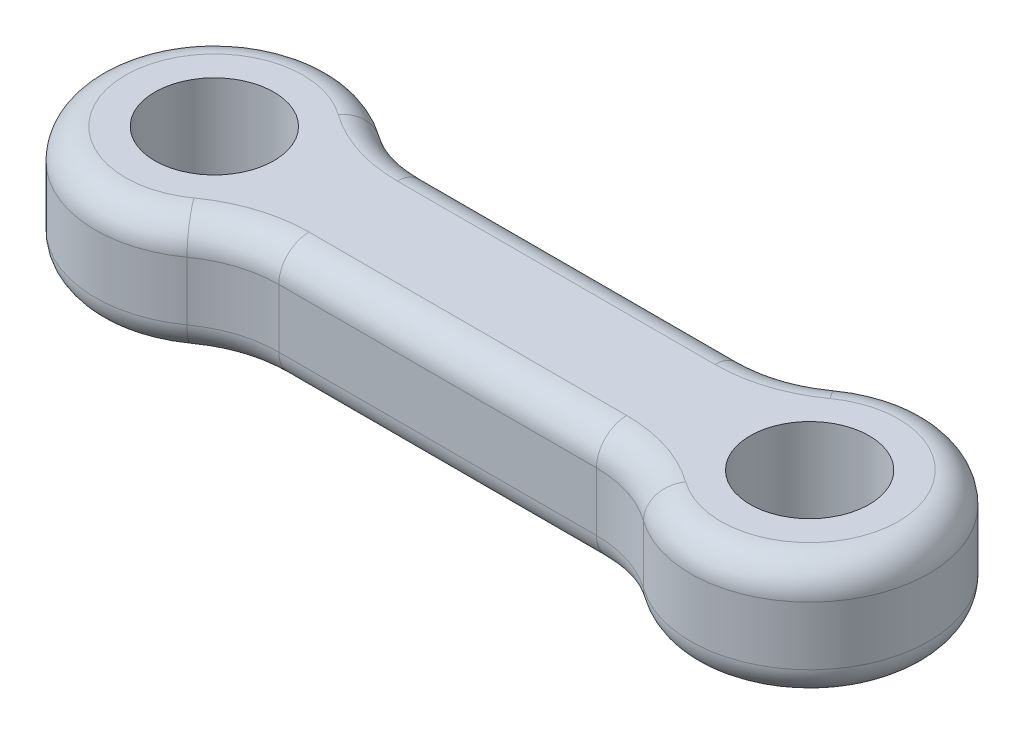
ISO-10303-21;
HEADER;
FILE_DESCRIPTION(('STEP AP214'),'2;1');
FILE_NAME('part.step','',(''),(''),'','','');
FILE_SCHEMA(('AUTOMOTIVE_DESIGN { 1 0 10303 214 1 1 1 1 }'));
ENDSEC;
DATA;
#1=APPLICATION_CONTEXT('core data for automotive mechanical design processes');
#2=APPLICATION_PROTOCOL_DEFINITION('international standard','automotive_design',2000,#1);
#3=PRODUCT_CONTEXT('',#1,'mechanical');
#4=PRODUCT('Part','Part','',(#3));
#5=PRODUCT_RELATED_PRODUCT_CATEGORY('part','',(#4));
#6=PRODUCT_DEFINITION_FORMATION('','',#4);
#7=PRODUCT_DEFINITION_CONTEXT('part definition',#1,'design');
#8=PRODUCT_DEFINITION('design','',#6,#7);
#9=PRODUCT_DEFINITION_SHAPE('','',#8);
#10=(LENGTH_UNIT() NAMED_UNIT(*) SI_UNIT(.MILLI.,.METRE.));
#11=(NAMED_UNIT(*) PLANE_ANGLE_UNIT() SI_UNIT($,.RADIAN.));
#12=(NAMED_UNIT(*) SI_UNIT($,.STERADIAN.) SOLID_ANGLE_UNIT());
#13=UNCERTAINTY_MEASURE_WITH_UNIT(LENGTH_MEASURE(1.E-05),#10,'distance_accuracy_value','');
#14=(GEOMETRIC_REPRESENTATION_CONTEXT(3) GLOBAL_UNCERTAINTY_ASSIGNED_CONTEXT((#13)) GLOBAL_UNIT_ASSIGNED_CONTEXT((#10,
#11,#12)) REPRESENTATION_CONTEXT('',''));
#15=CARTESIAN_POINT('',(0.,0.,0.));
#16=DIRECTION('',(0.,0.,1.));
#17=DIRECTION('',(1.,0.,0.));
#18=AXIS2_PLACEMENT_3D('',#15,#16,#17);
#19=CARTESIAN_POINT('',(3.69508771879827,8.3,-10.725));
#20=DIRECTION('',(0.,1.,0.));
#21=DIRECTION('',(0.,0.,1.));
#22=AXIS2_PLACEMENT_3D('',#19,#20,#21);
#23=PLANE('',#22);
#24=CARTESIAN_POINT('',(21.3049122812017,8.3,10.725));
#25=DIRECTION('',(0.,1.,0.));
#26=DIRECTION('',(0.,0.,1.));
#27=AXIS2_PLACEMENT_3D('',#24,#25,#26);
#28=CIRCLE('',#27,8.2764);
#29=CARTESIAN_POINT('',(21.3049122812017,8.3,2.4486));
#30=VERTEX_POINT('',#29);
#31=CARTESIAN_POINT('',(26.1297322808882,8.3,4.000425));
#32=VERTEX_POINT('',#31);
#33=EDGE_CURVE('E268',#30,#32,#28,.F.);
#34=ORIENTED_EDGE('',*,*,#33,.T.);
#35=CARTESIAN_POINT('',(29.,8.3,0.));
#36=DIRECTION('',(0.,1.,0.));
#37=DIRECTION('',(0.,0.,1.));
#38=AXIS2_PLACEMENT_3D('',#35,#36,#37);
#39=CIRCLE('',#38,4.9236);
#40=CARTESIAN_POINT('',(26.1297322808882,8.3,-4.000425));
#41=VERTEX_POINT('',#40);
#42=EDGE_CURVE('E155',#32,#41,#39,.T.);
#43=ORIENTED_EDGE('',*,*,#42,.T.);
#44=CARTESIAN_POINT('',(21.3049122812017,8.3,-10.725));
#45=DIRECTION('',(0.,1.,0.));
#46=DIRECTION('',(0.,0.,1.));
#47=AXIS2_PLACEMENT_3D('',#44,#45,#46);
#48=CIRCLE('',#47,8.2764);
#49=CARTESIAN_POINT('',(21.3049122812017,8.3,-2.4486));
#50=VERTEX_POINT('',#49);
#51=EDGE_CURVE('E149',#41,#50,#48,.F.);
#52=ORIENTED_EDGE('',*,*,#51,.T.);
#53=DIRECTION('',(-1.,0.,0.));
#54=VECTOR('',#53,1.);
#55=CARTESIAN_POINT('',(3.69508771879827,8.3,-2.4486));
#56=LINE('',#55,#54);
#57=CARTESIAN_POINT('',(3.69508771879827,8.3,-2.4486));
#58=VERTEX_POINT('',#57);
#59=EDGE_CURVE('E152',#50,#58,#56,.T.);
#60=ORIENTED_EDGE('',*,*,#59,.T.);
#61=CARTESIAN_POINT('',(3.69508771879827,8.3,-10.725));
#62=DIRECTION('',(0.,1.,0.));
#63=DIRECTION('',(0.,0.,1.));
#64=AXIS2_PLACEMENT_3D('',#61,#62,#63);
#65=CIRCLE('',#64,8.2764);
#66=CARTESIAN_POINT('',(-1.12973228088824,8.3,-4.000425));
#67=VERTEX_POINT('',#66);
#68=EDGE_CURVE('E159',#58,#67,#65,.F.);
#69=ORIENTED_EDGE('',*,*,#68,.T.);
#70=CARTESIAN_POINT('',(-4.,8.3,0.));
#71=DIRECTION('',(0.,1.,0.));
#72=DIRECTION('',(0.,0.,1.));
#73=AXIS2_PLACEMENT_3D('',#70,#71,#72);
#74=CIRCLE('',#73,4.9236);
#75=CARTESIAN_POINT('',(-1.12973228088825,8.3,4.000425));
#76=VERTEX_POINT('',#75);
#77=EDGE_CURVE('E274',#67,#76,#74,.T.);
#78=ORIENTED_EDGE('',*,*,#77,.T.);
#79=CARTESIAN_POINT('',(3.69508771879827,8.3,10.725));
#80=DIRECTION('',(0.,1.,0.));
#81=DIRECTION('',(0.,0.,1.));
#82=AXIS2_PLACEMENT_3D('',#79,#80,#81);
#83=CIRCLE('',#82,8.2764);
#84=CARTESIAN_POINT('',(3.69508771879827,8.3,2.4486));
#85=VERTEX_POINT('',#84);
#86=EDGE_CURVE('E272',#76,#85,#83,.F.);
#87=ORIENTED_EDGE('',*,*,#86,.T.);
#88=DIRECTION('',(1.,0.,0.));
#89=VECTOR('',#88,1.);
#90=CARTESIAN_POINT('',(21.3049122812017,8.3,2.4486));
#91=LINE('',#90,#89);
#92=EDGE_CURVE('E270',#85,#30,#91,.T.);
#93=ORIENTED_EDGE('',*,*,#92,.T.);
#94=EDGE_LOOP('',(#34,#43,#52,#60,#69,#78,#87,#93));
#95=FACE_BOUND('',#94,.T.);
#96=CARTESIAN_POINT('',(-4.,8.3,0.));
#97=DIRECTION('',(0.,1.,0.));
#98=DIRECTION('',(0.,0.,1.));
#99=AXIS2_PLACEMENT_3D('',#96,#97,#98);
#100=CIRCLE('',#99,3.3);
#101=CARTESIAN_POINT('',(-4.,8.3,3.3));
#102=VERTEX_POINT('',#101);
#103=EDGE_CURVE('E298',#102,#102,#100,.T.);
#104=ORIENTED_EDGE('',*,*,#103,.F.);
#105=EDGE_LOOP('',(#104));
#106=FACE_BOUND('',#105,.T.);
#107=CARTESIAN_POINT('',(29.,8.3,0.));
#108=DIRECTION('',(0.,1.,0.));
#109=DIRECTION('',(0.,0.,-1.));
#110=AXIS2_PLACEMENT_3D('',#107,#108,#109);
#111=CIRCLE('',#110,3.3);
#112=CARTESIAN_POINT('',(29.,8.3,-3.3));
#113=VERTEX_POINT('',#112);
#114=EDGE_CURVE('E302',#113,#113,#111,.T.);
#115=ORIENTED_EDGE('',*,*,#114,.F.);
#116=EDGE_LOOP('',(#115));
#117=FACE_BOUND('',#116,.T.);
#118=ADVANCED_FACE('F34',(#95,#106,#117),#23,.T.);
#119=CARTESIAN_POINT('',(3.69508771879827,1.7,-10.725));
#120=DIRECTION('',(0.,1.,0.));
#121=DIRECTION('',(0.,0.,1.));
#122=AXIS2_PLACEMENT_3D('',#119,#120,#121);
#123=PLANE('',#122);
#124=CARTESIAN_POINT('',(3.69508771879827,1.7,10.725));
#125=DIRECTION('',(0.,1.,0.));
#126=DIRECTION('',(0.,0.,1.));
#127=AXIS2_PLACEMENT_3D('',#124,#125,#126);
#128=CIRCLE('',#127,8.2764);
#129=CARTESIAN_POINT('',(3.69508771879827,1.7,2.4486));
#130=VERTEX_POINT('',#129);
#131=CARTESIAN_POINT('',(-1.12973228088825,1.7,4.000425));
#132=VERTEX_POINT('',#131);
#133=EDGE_CURVE('E227',#130,#132,#128,.T.);
#134=ORIENTED_EDGE('',*,*,#133,.T.);
#135=CARTESIAN_POINT('',(-4.,1.7,0.));
#136=DIRECTION('',(0.,1.,0.));
#137=DIRECTION('',(0.,0.,1.));
#138=AXIS2_PLACEMENT_3D('',#135,#136,#137);
#139=CIRCLE('',#138,4.9236);
#140=CARTESIAN_POINT('',(-1.12973228088824,1.7,-4.000425));
#141=VERTEX_POINT('',#140);
#142=EDGE_CURVE('E224',#132,#141,#139,.F.);
#143=ORIENTED_EDGE('',*,*,#142,.T.);
#144=CARTESIAN_POINT('',(3.69508771879827,1.7,-10.725));
#145=DIRECTION('',(0.,1.,0.));
#146=DIRECTION('',(0.,0.,1.));
#147=AXIS2_PLACEMENT_3D('',#144,#145,#146);
#148=CIRCLE('',#147,8.2764);
#149=CARTESIAN_POINT('',(3.69508771879827,1.7,-2.4486));
#150=VERTEX_POINT('',#149);
#151=EDGE_CURVE('E239',#141,#150,#148,.T.);
#152=ORIENTED_EDGE('',*,*,#151,.T.);
#153=DIRECTION('',(-1.,0.,0.));
#154=VECTOR('',#153,1.);
#155=CARTESIAN_POINT('',(3.69508771879827,1.7,-2.4486));
#156=LINE('',#155,#154);
#157=CARTESIAN_POINT('',(21.3049122812017,1.7,-2.4486));
#158=VERTEX_POINT('',#157);
#159=EDGE_CURVE('E237',#150,#158,#156,.F.);
#160=ORIENTED_EDGE('',*,*,#159,.T.);
#161=CARTESIAN_POINT('',(21.3049122812017,1.7,-10.725));
#162=DIRECTION('',(0.,1.,0.));
#163=DIRECTION('',(0.,0.,1.));
#164=AXIS2_PLACEMENT_3D('',#161,#162,#163);
#165=CIRCLE('',#164,8.2764);
#166=CARTESIAN_POINT('',(26.1297322808882,1.7,-4.000425));
#167=VERTEX_POINT('',#166);
#168=EDGE_CURVE('E235',#158,#167,#165,.T.);
#169=ORIENTED_EDGE('',*,*,#168,.T.);
#170=CARTESIAN_POINT('',(29.,1.7,0.));
#171=DIRECTION('',(0.,1.,0.));
#172=DIRECTION('',(0.,0.,1.));
#173=AXIS2_PLACEMENT_3D('',#170,#171,#172);
#174=CIRCLE('',#173,4.9236);
#175=CARTESIAN_POINT('',(26.1297322808883,1.7,4.000425));
#176=VERTEX_POINT('',#175);
#177=EDGE_CURVE('E233',#167,#176,#174,.F.);
#178=ORIENTED_EDGE('',*,*,#177,.T.);
#179=CARTESIAN_POINT('',(21.3049122812017,1.7,10.725));
#180=DIRECTION('',(0.,1.,0.));
#181=DIRECTION('',(0.,0.,1.));
#182=AXIS2_PLACEMENT_3D('',#179,#180,#181);
#183=CIRCLE('',#182,8.2764);
#184=CARTESIAN_POINT('',(21.3049122812017,1.7,2.4486));
#185=VERTEX_POINT('',#184);
#186=EDGE_CURVE('E231',#176,#185,#183,.T.);
#187=ORIENTED_EDGE('',*,*,#186,.T.);
#188=DIRECTION('',(1.,0.,0.));
#189=VECTOR('',#188,1.);
#190=CARTESIAN_POINT('',(3.69508771879827,1.7,2.4486));
#191=LINE('',#190,#189);
#192=EDGE_CURVE('E229',#185,#130,#191,.F.);
#193=ORIENTED_EDGE('',*,*,#192,.T.);
#194=EDGE_LOOP('',(#134,#143,#152,#160,#169,#178,#187,#193));
#195=FACE_BOUND('',#194,.T.);
#196=CARTESIAN_POINT('',(-4.,1.7,0.));
#197=DIRECTION('',(0.,1.,0.));
#198=DIRECTION('',(0.,0.,1.));
#199=AXIS2_PLACEMENT_3D('',#196,#197,#198);
#200=CIRCLE('',#199,3.3);
#201=CARTESIAN_POINT('',(-4.,1.7,3.3));
#202=VERTEX_POINT('',#201);
#203=EDGE_CURVE('E299',#202,#202,#200,.T.);
#204=ORIENTED_EDGE('',*,*,#203,.T.);
#205=EDGE_LOOP('',(#204));
#206=FACE_BOUND('',#205,.T.);
#207=CARTESIAN_POINT('',(29.,1.7,0.));
#208=DIRECTION('',(0.,1.,0.));
#209=DIRECTION('',(0.,0.,-1.));
#210=AXIS2_PLACEMENT_3D('',#207,#208,#209);
#211=CIRCLE('',#210,3.3);
#212=CARTESIAN_POINT('',(29.,1.7,-3.3));
#213=VERTEX_POINT('',#212);
#214=EDGE_CURVE('E192',#213,#213,#211,.T.);
#215=ORIENTED_EDGE('',*,*,#214,.T.);
#216=EDGE_LOOP('',(#215));
#217=FACE_BOUND('',#216,.T.);
#218=ADVANCED_FACE('F314',(#195,#206,#217),#123,.F.);
#219=CARTESIAN_POINT('',(3.69508771879827,8.3,-10.725));
#220=DIRECTION('',(0.,-1.,0.));
#221=DIRECTION('',(0.,0.,-1.));
#222=AXIS2_PLACEMENT_3D('',#219,#220,#221);
#223=CYLINDRICAL_SURFACE('',#222,6.6);
#224=DIRECTION('',(0.,-1.,0.));
#225=VECTOR('',#224,1.);
#226=CARTESIAN_POINT('',(-0.152456140600862,8.3,-5.3625));
#227=LINE('',#226,#225);
#228=CARTESIAN_POINT('',(-0.152456140600862,6.6236,-5.3625));
#229=VERTEX_POINT('',#228);
#230=CARTESIAN_POINT('',(-0.152456140600862,3.3764,-5.3625));
#231=VERTEX_POINT('',#230);
#232=EDGE_CURVE('E169',#229,#231,#227,.T.);
#233=ORIENTED_EDGE('',*,*,#232,.F.);
#234=CARTESIAN_POINT('',(3.69508771879827,6.6236,-10.725));
#235=DIRECTION('',(0.,1.,0.));
#236=DIRECTION('',(0.,0.,1.));
#237=AXIS2_PLACEMENT_3D('',#234,#235,#236);
#238=CIRCLE('',#237,6.6);
#239=CARTESIAN_POINT('',(3.69508771879827,6.6236,-4.125));
#240=VERTEX_POINT('',#239);
#241=EDGE_CURVE('E241',#229,#240,#238,.T.);
#242=ORIENTED_EDGE('',*,*,#241,.T.);
#243=DIRECTION('',(0.,-1.,0.));
#244=VECTOR('',#243,1.);
#245=CARTESIAN_POINT('',(3.69508771879827,8.3,-4.125));
#246=LINE('',#245,#244);
#247=CARTESIAN_POINT('',(3.69508771879827,3.3764,-4.125));
#248=VERTEX_POINT('',#247);
#249=EDGE_CURVE('E295',#240,#248,#246,.T.);
#250=ORIENTED_EDGE('',*,*,#249,.T.);
#251=CARTESIAN_POINT('',(3.69508771879827,3.3764,-10.725));
#252=DIRECTION('',(0.,1.,0.));
#253=DIRECTION('',(0.,0.,1.));
#254=AXIS2_PLACEMENT_3D('',#251,#252,#253);
#255=CIRCLE('',#254,6.6);
#256=EDGE_CURVE('E243',#248,#231,#255,.F.);
#257=ORIENTED_EDGE('',*,*,#256,.T.);
#258=EDGE_LOOP('',(#233,#242,#250,#257));
#259=FACE_BOUND('',#258,.T.);
#260=ADVANCED_FACE('F319',(#259),#223,.F.);
#261=CARTESIAN_POINT('',(-4.,8.3,0.));
#262=DIRECTION('',(0.,-1.,0.));
#263=DIRECTION('',(0.,0.,-1.));
#264=AXIS2_PLACEMENT_3D('',#261,#262,#263);
#265=CYLINDRICAL_SURFACE('',#264,6.6);
#266=DIRECTION('',(0.,-1.,0.));
#267=VECTOR('',#266,1.);
#268=CARTESIAN_POINT('',(-0.152456140600865,8.3,5.3625));
#269=LINE('',#268,#267);
#270=CARTESIAN_POINT('',(-0.152456140600865,6.6236,5.3625));
#271=VERTEX_POINT('',#270);
#272=CARTESIAN_POINT('',(-0.152456140600865,3.3764,5.3625));
#273=VERTEX_POINT('',#272);
#274=EDGE_CURVE('E279',#271,#273,#269,.T.);
#275=ORIENTED_EDGE('',*,*,#274,.F.);
#276=CARTESIAN_POINT('',(-4.,6.6236,0.));
#277=DIRECTION('',(0.,1.,0.));
#278=DIRECTION('',(0.,0.,1.));
#279=AXIS2_PLACEMENT_3D('',#276,#277,#278);
#280=CIRCLE('',#279,6.6);
#281=EDGE_CURVE('E245',#271,#229,#280,.F.);
#282=ORIENTED_EDGE('',*,*,#281,.T.);
#283=ORIENTED_EDGE('',*,*,#232,.T.);
#284=CARTESIAN_POINT('',(-4.,3.3764,0.));
#285=DIRECTION('',(0.,1.,0.));
#286=DIRECTION('',(0.,0.,1.));
#287=AXIS2_PLACEMENT_3D('',#284,#285,#286);
#288=CIRCLE('',#287,6.6);
#289=EDGE_CURVE('E247',#231,#273,#288,.T.);
#290=ORIENTED_EDGE('',*,*,#289,.T.);
#291=EDGE_LOOP('',(#275,#282,#283,#290));
#292=FACE_BOUND('',#291,.T.);
#293=ADVANCED_FACE('F347',(#292),#265,.T.);
#294=CARTESIAN_POINT('',(3.69508771879827,8.3,10.725));
#295=DIRECTION('',(0.,-1.,0.));
#296=DIRECTION('',(0.,0.,-1.));
#297=AXIS2_PLACEMENT_3D('',#294,#295,#296);
#298=CYLINDRICAL_SURFACE('',#297,6.6);
#299=DIRECTION('',(0.,-1.,0.));
#300=VECTOR('',#299,1.);
#301=CARTESIAN_POINT('',(3.69508771879827,8.3,4.125));
#302=LINE('',#301,#300);
#303=CARTESIAN_POINT('',(3.69508771879827,6.6236,4.125));
#304=VERTEX_POINT('',#303);
#305=CARTESIAN_POINT('',(3.69508771879827,3.3764,4.125));
#306=VERTEX_POINT('',#305);
#307=EDGE_CURVE('E282',#304,#306,#302,.T.);
#308=ORIENTED_EDGE('',*,*,#307,.F.);
#309=CARTESIAN_POINT('',(3.69508771879827,6.6236,10.725));
#310=DIRECTION('',(0.,1.,0.));
#311=DIRECTION('',(0.,0.,1.));
#312=AXIS2_PLACEMENT_3D('',#309,#310,#311);
#313=CIRCLE('',#312,6.6);
#314=EDGE_CURVE('E250',#304,#271,#313,.T.);
#315=ORIENTED_EDGE('',*,*,#314,.T.);
#316=ORIENTED_EDGE('',*,*,#274,.T.);
#317=CARTESIAN_POINT('',(3.69508771879827,3.3764,10.725));
#318=DIRECTION('',(0.,1.,0.));
#319=DIRECTION('',(0.,0.,1.));
#320=AXIS2_PLACEMENT_3D('',#317,#318,#319);
#321=CIRCLE('',#320,6.6);
#322=EDGE_CURVE('E252',#273,#306,#321,.F.);
#323=ORIENTED_EDGE('',*,*,#322,.T.);
#324=EDGE_LOOP('',(#308,#315,#316,#323));
#325=FACE_BOUND('',#324,.T.);
#326=ADVANCED_FACE('F343',(#325),#298,.F.);
#327=CARTESIAN_POINT('',(3.69508771879827,8.3,4.125));
#328=DIRECTION('',(0.,0.,-1.));
#329=DIRECTION('',(-1.,0.,0.));
#330=AXIS2_PLACEMENT_3D('',#327,#328,#329);
#331=PLANE('',#330);
#332=DIRECTION('',(0.,-1.,0.));
#333=VECTOR('',#332,1.);
#334=CARTESIAN_POINT('',(21.3049122812017,8.3,4.125));
#335=LINE('',#334,#333);
#336=CARTESIAN_POINT('',(21.3049122812017,6.6236,4.125));
#337=VERTEX_POINT('',#336);
#338=CARTESIAN_POINT('',(21.3049122812017,3.3764,4.125));
#339=VERTEX_POINT('',#338);
#340=EDGE_CURVE('E285',#337,#339,#335,.T.);
#341=ORIENTED_EDGE('',*,*,#340,.F.);
#342=DIRECTION('',(1.,0.,0.));
#343=VECTOR('',#342,1.);
#344=CARTESIAN_POINT('',(3.69508771879827,6.6236,4.125));
#345=LINE('',#344,#343);
#346=EDGE_CURVE('E254',#337,#304,#345,.F.);
#347=ORIENTED_EDGE('',*,*,#346,.T.);
#348=ORIENTED_EDGE('',*,*,#307,.T.);
#349=DIRECTION('',(1.,0.,0.));
#350=VECTOR('',#349,1.);
#351=CARTESIAN_POINT('',(3.69508771879827,3.3764,4.125));
#352=LINE('',#351,#350);
#353=EDGE_CURVE('E256',#306,#339,#352,.T.);
#354=ORIENTED_EDGE('',*,*,#353,.T.);
#355=EDGE_LOOP('',(#341,#347,#348,#354));
#356=FACE_BOUND('',#355,.T.);
#357=ADVANCED_FACE('F339',(#356),#331,.F.);
#358=CARTESIAN_POINT('',(21.3049122812017,8.3,10.725));
#359=DIRECTION('',(0.,-1.,0.));
#360=DIRECTION('',(0.,0.,-1.));
#361=AXIS2_PLACEMENT_3D('',#358,#359,#360);
#362=CYLINDRICAL_SURFACE('',#361,6.6);
#363=DIRECTION('',(0.,-1.,0.));
#364=VECTOR('',#363,1.);
#365=CARTESIAN_POINT('',(25.1524561406009,8.3,5.3625));
#366=LINE('',#365,#364);
#367=CARTESIAN_POINT('',(25.1524561406009,6.6236,5.3625));
#368=VERTEX_POINT('',#367);
#369=CARTESIAN_POINT('',(25.1524561406009,3.3764,5.3625));
#370=VERTEX_POINT('',#369);
#371=EDGE_CURVE('E288',#368,#370,#366,.T.);
#372=ORIENTED_EDGE('',*,*,#371,.F.);
#373=CARTESIAN_POINT('',(21.3049122812017,6.6236,10.725));
#374=DIRECTION('',(0.,1.,0.));
#375=DIRECTION('',(0.,0.,1.));
#376=AXIS2_PLACEMENT_3D('',#373,#374,#375);
#377=CIRCLE('',#376,6.6);
#378=EDGE_CURVE('E258',#368,#337,#377,.T.);
#379=ORIENTED_EDGE('',*,*,#378,.T.);
#380=ORIENTED_EDGE('',*,*,#340,.T.);
#381=CARTESIAN_POINT('',(21.3049122812017,3.3764,10.725));
#382=DIRECTION('',(0.,1.,0.));
#383=DIRECTION('',(0.,0.,1.));
#384=AXIS2_PLACEMENT_3D('',#381,#382,#383);
#385=CIRCLE('',#384,6.6);
#386=EDGE_CURVE('E260',#339,#370,#385,.F.);
#387=ORIENTED_EDGE('',*,*,#386,.T.);
#388=EDGE_LOOP('',(#372,#379,#380,#387));
#389=FACE_BOUND('',#388,.T.);
#390=ADVANCED_FACE('F335',(#389),#362,.F.);
#391=CARTESIAN_POINT('',(29.,8.3,0.));
#392=DIRECTION('',(0.,-1.,0.));
#393=DIRECTION('',(0.,0.,-1.));
#394=AXIS2_PLACEMENT_3D('',#391,#392,#393);
#395=CYLINDRICAL_SURFACE('',#394,6.6);
#396=DIRECTION('',(0.,-1.,0.));
#397=VECTOR('',#396,1.);
#398=CARTESIAN_POINT('',(25.1524561406009,8.3,-5.3625));
#399=LINE('',#398,#397);
#400=CARTESIAN_POINT('',(25.1524561406009,6.6236,-5.3625));
#401=VERTEX_POINT('',#400);
#402=CARTESIAN_POINT('',(25.1524561406009,3.3764,-5.3625));
#403=VERTEX_POINT('',#402);
#404=EDGE_CURVE('E291',#401,#403,#399,.T.);
#405=ORIENTED_EDGE('',*,*,#404,.F.);
#406=CARTESIAN_POINT('',(29.,6.6236,0.));
#407=DIRECTION('',(0.,1.,0.));
#408=DIRECTION('',(0.,0.,1.));
#409=AXIS2_PLACEMENT_3D('',#406,#407,#408);
#410=CIRCLE('',#409,6.6);
#411=EDGE_CURVE('E262',#401,#368,#410,.F.);
#412=ORIENTED_EDGE('',*,*,#411,.T.);
#413=ORIENTED_EDGE('',*,*,#371,.T.);
#414=CARTESIAN_POINT('',(29.,3.3764,0.));
#415=DIRECTION('',(0.,1.,0.));
#416=DIRECTION('',(0.,0.,1.));
#417=AXIS2_PLACEMENT_3D('',#414,#415,#416);
#418=CIRCLE('',#417,6.6);
#419=EDGE_CURVE('E265',#370,#403,#418,.T.);
#420=ORIENTED_EDGE('',*,*,#419,.T.);
#421=EDGE_LOOP('',(#405,#412,#413,#420));
#422=FACE_BOUND('',#421,.T.);
#423=ADVANCED_FACE('F332',(#422),#395,.T.);
#424=CARTESIAN_POINT('',(21.3049122812017,8.3,-10.725));
#425=DIRECTION('',(0.,-1.,0.));
#426=DIRECTION('',(0.,0.,-1.));
#427=AXIS2_PLACEMENT_3D('',#424,#425,#426);
#428=CYLINDRICAL_SURFACE('',#427,6.6);
#429=ORIENTED_EDGE('',*,*,#404,.T.);
#430=CARTESIAN_POINT('',(21.3049122812017,3.3764,-10.725));
#431=DIRECTION('',(0.,1.,0.));
#432=DIRECTION('',(0.,0.,1.));
#433=AXIS2_PLACEMENT_3D('',#430,#431,#432);
#434=CIRCLE('',#433,6.6);
#435=CARTESIAN_POINT('',(21.3049122812017,3.3764,-4.125));
#436=VERTEX_POINT('',#435);
#437=EDGE_CURVE('E51',#403,#436,#434,.F.);
#438=ORIENTED_EDGE('',*,*,#437,.T.);
#439=DIRECTION('',(0.,-1.,0.));
#440=VECTOR('',#439,1.);
#441=CARTESIAN_POINT('',(21.3049122812017,8.3,-4.125));
#442=LINE('',#441,#440);
#443=CARTESIAN_POINT('',(21.3049122812017,6.6236,-4.125));
#444=VERTEX_POINT('',#443);
#445=EDGE_CURVE('E293',#444,#436,#442,.T.);
#446=ORIENTED_EDGE('',*,*,#445,.F.);
#447=CARTESIAN_POINT('',(21.3049122812017,6.6236,-10.725));
#448=DIRECTION('',(0.,1.,0.));
#449=DIRECTION('',(0.,0.,1.));
#450=AXIS2_PLACEMENT_3D('',#447,#448,#449);
#451=CIRCLE('',#450,6.6);
#452=EDGE_CURVE('E172',#444,#401,#451,.T.);
#453=ORIENTED_EDGE('',*,*,#452,.T.);
#454=EDGE_LOOP('',(#429,#438,#446,#453));
#455=FACE_BOUND('',#454,.T.);
#456=ADVANCED_FACE('F329',(#455),#428,.F.);
#457=CARTESIAN_POINT('',(3.69508771879827,8.3,-4.125));
#458=DIRECTION('',(0.,0.,1.));
#459=DIRECTION('',(1.,0.,0.));
#460=AXIS2_PLACEMENT_3D('',#457,#458,#459);
#461=PLANE('',#460);
#462=ORIENTED_EDGE('',*,*,#445,.T.);
#463=DIRECTION('',(-1.,0.,0.));
#464=VECTOR('',#463,1.);
#465=CARTESIAN_POINT('',(3.69508771879827,3.3764,-4.125));
#466=LINE('',#465,#464);
#467=EDGE_CURVE('E11',#436,#248,#466,.T.);
#468=ORIENTED_EDGE('',*,*,#467,.T.);
#469=ORIENTED_EDGE('',*,*,#249,.F.);
#470=DIRECTION('',(-1.,0.,0.));
#471=VECTOR('',#470,1.);
#472=CARTESIAN_POINT('',(21.3049122812017,6.6236,-4.125));
#473=LINE('',#472,#471);
#474=EDGE_CURVE('E43',#240,#444,#473,.F.);
#475=ORIENTED_EDGE('',*,*,#474,.T.);
#476=EDGE_LOOP('',(#462,#468,#469,#475));
#477=FACE_BOUND('',#476,.T.);
#478=ADVANCED_FACE('F326',(#477),#461,.F.);
#479=CARTESIAN_POINT('',(-4.,8.3,0.));
#480=DIRECTION('',(0.,-1.,0.));
#481=DIRECTION('',(0.,0.,-1.));
#482=AXIS2_PLACEMENT_3D('',#479,#480,#481);
#483=CYLINDRICAL_SURFACE('',#482,3.3);
#484=ORIENTED_EDGE('',*,*,#103,.T.);
#485=EDGE_LOOP('',(#484));
#486=FACE_BOUND('',#485,.T.);
#487=ORIENTED_EDGE('',*,*,#203,.F.);
#488=EDGE_LOOP('',(#487));
#489=FACE_BOUND('',#488,.T.);
#490=ADVANCED_FACE('F323',(#486,#489),#483,.F.);
#491=CARTESIAN_POINT('',(29.,8.3,0.));
#492=DIRECTION('',(0.,-1.,0.));
#493=DIRECTION('',(0.,0.,-1.));
#494=AXIS2_PLACEMENT_3D('',#491,#492,#493);
#495=CYLINDRICAL_SURFACE('',#494,3.3);
#496=ORIENTED_EDGE('',*,*,#114,.T.);
#497=EDGE_LOOP('',(#496));
#498=FACE_BOUND('',#497,.T.);
#499=ORIENTED_EDGE('',*,*,#214,.F.);
#500=EDGE_LOOP('',(#499));
#501=FACE_BOUND('',#500,.T.);
#502=ADVANCED_FACE('F310',(#498,#501),#495,.F.);
#503=CARTESIAN_POINT('',(-4.,6.6236,0.));
#504=DIRECTION('',(0.,1.,0.));
#505=DIRECTION('',(0.,0.,1.));
#506=AXIS2_PLACEMENT_3D('',#503,#504,#505);
#507=TOROIDAL_SURFACE('',#506,4.9236,1.6764);
#508=CARTESIAN_POINT('',(-1.12973228088824,6.6236,-4.000425));
#509=DIRECTION('',(0.8125,0.,0.582961190818051));
#510=DIRECTION('',(0.582961190818051,0.,-0.8125));
#511=AXIS2_PLACEMENT_3D('',#508,#509,#510);
#512=CIRCLE('',#511,1.6764);
#513=EDGE_CURVE('E186',#229,#67,#512,.T.);
#514=ORIENTED_EDGE('',*,*,#513,.F.);
#515=ORIENTED_EDGE('',*,*,#281,.F.);
#516=CARTESIAN_POINT('',(-1.12973228088825,6.6236,4.000425));
#517=DIRECTION('',(0.8125,0.,-0.582961190818051));
#518=DIRECTION('',(-0.582961190818051,0.,-0.8125));
#519=AXIS2_PLACEMENT_3D('',#516,#517,#518);
#520=CIRCLE('',#519,1.6764);
#521=EDGE_CURVE('E189',#76,#271,#520,.T.);
#522=ORIENTED_EDGE('',*,*,#521,.F.);
#523=ORIENTED_EDGE('',*,*,#77,.F.);
#524=EDGE_LOOP('',(#514,#515,#522,#523));
#525=FACE_BOUND('',#524,.T.);
#526=ADVANCED_FACE('F377',(#525),#507,.T.);
#527=CARTESIAN_POINT('',(3.69508771879827,6.6236,10.725));
#528=DIRECTION('',(0.,1.,0.));
#529=DIRECTION('',(0.,0.,1.));
#530=AXIS2_PLACEMENT_3D('',#527,#528,#529);
#531=TOROIDAL_SURFACE('',#530,8.2764,1.6764);
#532=ORIENTED_EDGE('',*,*,#521,.T.);
#533=ORIENTED_EDGE('',*,*,#314,.F.);
#534=CARTESIAN_POINT('',(3.69508771879827,6.6236,2.4486));
#535=DIRECTION('',(1.,0.,0.));
#536=DIRECTION('',(0.,0.,-1.));
#537=AXIS2_PLACEMENT_3D('',#534,#535,#536);
#538=CIRCLE('',#537,1.6764);
#539=EDGE_CURVE('E183',#85,#304,#538,.T.);
#540=ORIENTED_EDGE('',*,*,#539,.F.);
#541=ORIENTED_EDGE('',*,*,#86,.F.);
#542=EDGE_LOOP('',(#532,#533,#540,#541));
#543=FACE_BOUND('',#542,.T.);
#544=ADVANCED_FACE('F373',(#543),#531,.T.);
#545=CARTESIAN_POINT('',(3.69508771879827,6.6236,-10.725));
#546=DIRECTION('',(0.,1.,0.));
#547=DIRECTION('',(0.,0.,1.));
#548=AXIS2_PLACEMENT_3D('',#545,#546,#547);
#549=TOROIDAL_SURFACE('',#548,8.2764,1.6764);
#550=ORIENTED_EDGE('',*,*,#513,.T.);
#551=ORIENTED_EDGE('',*,*,#68,.F.);
#552=CARTESIAN_POINT('',(3.69508771879827,6.6236,-2.4486));
#553=DIRECTION('',(1.,0.,0.));
#554=DIRECTION('',(0.,0.,-1.));
#555=AXIS2_PLACEMENT_3D('',#552,#553,#554);
#556=CIRCLE('',#555,1.6764);
#557=EDGE_CURVE('E168',#240,#58,#556,.T.);
#558=ORIENTED_EDGE('',*,*,#557,.F.);
#559=ORIENTED_EDGE('',*,*,#241,.F.);
#560=EDGE_LOOP('',(#550,#551,#558,#559));
#561=FACE_BOUND('',#560,.T.);
#562=ADVANCED_FACE('F369',(#561),#549,.T.);
#563=CARTESIAN_POINT('',(3.69508771879827,6.6236,2.4486));
#564=DIRECTION('',(-1.,0.,0.));
#565=DIRECTION('',(0.,0.,1.));
#566=AXIS2_PLACEMENT_3D('',#563,#564,#565);
#567=CYLINDRICAL_SURFACE('',#566,1.6764);
#568=ORIENTED_EDGE('',*,*,#539,.T.);
#569=ORIENTED_EDGE('',*,*,#346,.F.);
#570=CARTESIAN_POINT('',(21.3049122812017,6.6236,2.4486));
#571=DIRECTION('',(1.,0.,0.));
#572=DIRECTION('',(0.,0.,-1.));
#573=AXIS2_PLACEMENT_3D('',#570,#571,#572);
#574=CIRCLE('',#573,1.6764);
#575=EDGE_CURVE('E173',#30,#337,#574,.T.);
#576=ORIENTED_EDGE('',*,*,#575,.F.);
#577=ORIENTED_EDGE('',*,*,#92,.F.);
#578=EDGE_LOOP('',(#568,#569,#576,#577));
#579=FACE_BOUND('',#578,.T.);
#580=ADVANCED_FACE('F366',(#579),#567,.T.);
#581=CARTESIAN_POINT('',(3.69508771879827,6.6236,-2.4486));
#582=DIRECTION('',(1.,0.,0.));
#583=DIRECTION('',(0.,0.,-1.));
#584=AXIS2_PLACEMENT_3D('',#581,#582,#583);
#585=CYLINDRICAL_SURFACE('',#584,1.6764);
#586=ORIENTED_EDGE('',*,*,#557,.T.);
#587=ORIENTED_EDGE('',*,*,#59,.F.);
#588=CARTESIAN_POINT('',(21.3049122812017,6.6236,-2.4486));
#589=DIRECTION('',(1.,0.,0.));
#590=DIRECTION('',(0.,0.,-1.));
#591=AXIS2_PLACEMENT_3D('',#588,#589,#590);
#592=CIRCLE('',#591,1.6764);
#593=EDGE_CURVE('E165',#444,#50,#592,.T.);
#594=ORIENTED_EDGE('',*,*,#593,.F.);
#595=ORIENTED_EDGE('',*,*,#474,.F.);
#596=EDGE_LOOP('',(#586,#587,#594,#595));
#597=FACE_BOUND('',#596,.T.);
#598=ADVANCED_FACE('F164',(#597),#585,.T.);
#599=CARTESIAN_POINT('',(21.3049122812017,6.6236,10.725));
#600=DIRECTION('',(0.,1.,0.));
#601=DIRECTION('',(0.,0.,1.));
#602=AXIS2_PLACEMENT_3D('',#599,#600,#601);
#603=TOROIDAL_SURFACE('',#602,8.2764,1.6764);
#604=ORIENTED_EDGE('',*,*,#575,.T.);
#605=ORIENTED_EDGE('',*,*,#378,.F.);
#606=CARTESIAN_POINT('',(26.1297322808882,6.6236,4.000425));
#607=DIRECTION('',(0.812500000000001,0.,0.582961190818049));
#608=DIRECTION('',(0.582961190818049,0.,-0.812500000000001));
#609=AXIS2_PLACEMENT_3D('',#606,#607,#608);
#610=CIRCLE('',#609,1.6764);
#611=EDGE_CURVE('E174',#32,#368,#610,.T.);
#612=ORIENTED_EDGE('',*,*,#611,.F.);
#613=ORIENTED_EDGE('',*,*,#33,.F.);
#614=EDGE_LOOP('',(#604,#605,#612,#613));
#615=FACE_BOUND('',#614,.T.);
#616=ADVANCED_FACE('F360',(#615),#603,.T.);
#617=CARTESIAN_POINT('',(21.3049122812017,6.6236,-10.725));
#618=DIRECTION('',(0.,1.,0.));
#619=DIRECTION('',(0.,0.,1.));
#620=AXIS2_PLACEMENT_3D('',#617,#618,#619);
#621=TOROIDAL_SURFACE('',#620,8.2764,1.6764);
#622=ORIENTED_EDGE('',*,*,#593,.T.);
#623=ORIENTED_EDGE('',*,*,#51,.F.);
#624=CARTESIAN_POINT('',(26.1297322808883,6.6236,-4.000425));
#625=DIRECTION('',(0.812499999999999,0.,-0.582961190818052));
#626=DIRECTION('',(-0.582961190818052,0.,-0.812499999999999));
#627=AXIS2_PLACEMENT_3D('',#624,#625,#626);
#628=CIRCLE('',#627,1.6764);
#629=EDGE_CURVE('E178',#401,#41,#628,.T.);
#630=ORIENTED_EDGE('',*,*,#629,.F.);
#631=ORIENTED_EDGE('',*,*,#452,.F.);
#632=EDGE_LOOP('',(#622,#623,#630,#631));
#633=FACE_BOUND('',#632,.T.);
#634=ADVANCED_FACE('F171',(#633),#621,.T.);
#635=CARTESIAN_POINT('',(29.,6.6236,0.));
#636=DIRECTION('',(0.,1.,0.));
#637=DIRECTION('',(0.,0.,1.));
#638=AXIS2_PLACEMENT_3D('',#635,#636,#637);
#639=TOROIDAL_SURFACE('',#638,4.9236,1.6764);
#640=ORIENTED_EDGE('',*,*,#611,.T.);
#641=ORIENTED_EDGE('',*,*,#411,.F.);
#642=ORIENTED_EDGE('',*,*,#629,.T.);
#643=ORIENTED_EDGE('',*,*,#42,.F.);
#644=EDGE_LOOP('',(#640,#641,#642,#643));
#645=FACE_BOUND('',#644,.T.);
#646=ADVANCED_FACE('F355',(#645),#639,.T.);
#647=CARTESIAN_POINT('',(29.,3.3764,0.));
#648=DIRECTION('',(0.,1.,0.));
#649=DIRECTION('',(0.,0.,1.));
#650=AXIS2_PLACEMENT_3D('',#647,#648,#649);
#651=TOROIDAL_SURFACE('',#650,4.9236,1.6764);
#652=CARTESIAN_POINT('',(26.1297322808883,3.3764,4.000425));
#653=DIRECTION('',(-0.812499999999999,0.,-0.582961190818052));
#654=DIRECTION('',(-0.582961190818052,0.,0.812499999999999));
#655=AXIS2_PLACEMENT_3D('',#652,#653,#654);
#656=CIRCLE('',#655,1.6764);
#657=EDGE_CURVE('E208',#176,#370,#656,.T.);
#658=ORIENTED_EDGE('',*,*,#657,.F.);
#659=ORIENTED_EDGE('',*,*,#177,.F.);
#660=CARTESIAN_POINT('',(26.1297322808882,3.3764,-4.000425));
#661=DIRECTION('',(-0.812500000000001,0.,0.58296119081805));
#662=DIRECTION('',(0.58296119081805,0.,0.812500000000001));
#663=AXIS2_PLACEMENT_3D('',#660,#661,#662);
#664=CIRCLE('',#663,1.6764);
#665=EDGE_CURVE('E38',#403,#167,#664,.T.);
#666=ORIENTED_EDGE('',*,*,#665,.F.);
#667=ORIENTED_EDGE('',*,*,#419,.F.);
#668=EDGE_LOOP('',(#658,#659,#666,#667));
#669=FACE_BOUND('',#668,.T.);
#670=ADVANCED_FACE('F36',(#669),#651,.T.);
#671=CARTESIAN_POINT('',(21.3049122812017,3.3764,-10.725));
#672=DIRECTION('',(0.,1.,0.));
#673=DIRECTION('',(0.,0.,1.));
#674=AXIS2_PLACEMENT_3D('',#671,#672,#673);
#675=TOROIDAL_SURFACE('',#674,8.2764,1.6764);
#676=ORIENTED_EDGE('',*,*,#665,.T.);
#677=ORIENTED_EDGE('',*,*,#168,.F.);
#678=CARTESIAN_POINT('',(21.3049122812017,3.3764,-2.4486));
#679=DIRECTION('',(-1.,0.,0.));
#680=DIRECTION('',(0.,0.,1.));
#681=AXIS2_PLACEMENT_3D('',#678,#679,#680);
#682=CIRCLE('',#681,1.6764);
#683=EDGE_CURVE('E206',#436,#158,#682,.T.);
#684=ORIENTED_EDGE('',*,*,#683,.F.);
#685=ORIENTED_EDGE('',*,*,#437,.F.);
#686=EDGE_LOOP('',(#676,#677,#684,#685));
#687=FACE_BOUND('',#686,.T.);
#688=ADVANCED_FACE('F404',(#687),#675,.T.);
#689=CARTESIAN_POINT('',(21.3049122812017,3.3764,10.725));
#690=DIRECTION('',(0.,1.,0.));
#691=DIRECTION('',(0.,0.,1.));
#692=AXIS2_PLACEMENT_3D('',#689,#690,#691);
#693=TOROIDAL_SURFACE('',#692,8.2764,1.6764);
#694=ORIENTED_EDGE('',*,*,#657,.T.);
#695=ORIENTED_EDGE('',*,*,#386,.F.);
#696=CARTESIAN_POINT('',(21.3049122812017,3.3764,2.4486));
#697=DIRECTION('',(-1.,0.,0.));
#698=DIRECTION('',(0.,0.,1.));
#699=AXIS2_PLACEMENT_3D('',#696,#697,#698);
#700=CIRCLE('',#699,1.6764);
#701=EDGE_CURVE('E203',#185,#339,#700,.T.);
#702=ORIENTED_EDGE('',*,*,#701,.F.);
#703=ORIENTED_EDGE('',*,*,#186,.F.);
#704=EDGE_LOOP('',(#694,#695,#702,#703));
#705=FACE_BOUND('',#704,.T.);
#706=ADVANCED_FACE('F401',(#705),#693,.T.);
#707=CARTESIAN_POINT('',(3.69508771879827,3.3764,-2.4486));
#708=DIRECTION('',(-1.,0.,0.));
#709=DIRECTION('',(0.,0.,1.));
#710=AXIS2_PLACEMENT_3D('',#707,#708,#709);
#711=CYLINDRICAL_SURFACE('',#710,1.6764);
#712=ORIENTED_EDGE('',*,*,#683,.T.);
#713=ORIENTED_EDGE('',*,*,#159,.F.);
#714=CARTESIAN_POINT('',(3.69508771879827,3.3764,-2.4486));
#715=DIRECTION('',(-1.,0.,0.));
#716=DIRECTION('',(0.,0.,1.));
#717=AXIS2_PLACEMENT_3D('',#714,#715,#716);
#718=CIRCLE('',#717,1.6764);
#719=EDGE_CURVE('E200',#248,#150,#718,.T.);
#720=ORIENTED_EDGE('',*,*,#719,.F.);
#721=ORIENTED_EDGE('',*,*,#467,.F.);
#722=EDGE_LOOP('',(#712,#713,#720,#721));
#723=FACE_BOUND('',#722,.T.);
#724=ADVANCED_FACE('F397',(#723),#711,.T.);
#725=CARTESIAN_POINT('',(3.69508771879827,3.3764,2.4486));
#726=DIRECTION('',(1.,0.,0.));
#727=DIRECTION('',(0.,0.,-1.));
#728=AXIS2_PLACEMENT_3D('',#725,#726,#727);
#729=CYLINDRICAL_SURFACE('',#728,1.6764);
#730=ORIENTED_EDGE('',*,*,#701,.T.);
#731=ORIENTED_EDGE('',*,*,#353,.F.);
#732=CARTESIAN_POINT('',(3.69508771879827,3.3764,2.4486));
#733=DIRECTION('',(-1.,0.,0.));
#734=DIRECTION('',(0.,0.,1.));
#735=AXIS2_PLACEMENT_3D('',#732,#733,#734);
#736=CIRCLE('',#735,1.6764);
#737=EDGE_CURVE('E197',#130,#306,#736,.T.);
#738=ORIENTED_EDGE('',*,*,#737,.F.);
#739=ORIENTED_EDGE('',*,*,#192,.F.);
#740=EDGE_LOOP('',(#730,#731,#738,#739));
#741=FACE_BOUND('',#740,.T.);
#742=ADVANCED_FACE('F393',(#741),#729,.T.);
#743=CARTESIAN_POINT('',(3.69508771879827,3.3764,-10.725));
#744=DIRECTION('',(0.,1.,0.));
#745=DIRECTION('',(0.,0.,1.));
#746=AXIS2_PLACEMENT_3D('',#743,#744,#745);
#747=TOROIDAL_SURFACE('',#746,8.2764,1.6764);
#748=ORIENTED_EDGE('',*,*,#719,.T.);
#749=ORIENTED_EDGE('',*,*,#151,.F.);
#750=CARTESIAN_POINT('',(-1.12973228088824,3.3764,-4.000425));
#751=DIRECTION('',(-0.8125,0.,-0.582961190818051));
#752=DIRECTION('',(-0.582961190818051,0.,0.8125));
#753=AXIS2_PLACEMENT_3D('',#750,#751,#752);
#754=CIRCLE('',#753,1.6764);
#755=EDGE_CURVE('E195',#231,#141,#754,.T.);
#756=ORIENTED_EDGE('',*,*,#755,.F.);
#757=ORIENTED_EDGE('',*,*,#256,.F.);
#758=EDGE_LOOP('',(#748,#749,#756,#757));
#759=FACE_BOUND('',#758,.T.);
#760=ADVANCED_FACE('F389',(#759),#747,.T.);
#761=CARTESIAN_POINT('',(3.69508771879827,3.3764,10.725));
#762=DIRECTION('',(0.,1.,0.));
#763=DIRECTION('',(0.,0.,1.));
#764=AXIS2_PLACEMENT_3D('',#761,#762,#763);
#765=TOROIDAL_SURFACE('',#764,8.2764,1.6764);
#766=ORIENTED_EDGE('',*,*,#737,.T.);
#767=ORIENTED_EDGE('',*,*,#322,.F.);
#768=CARTESIAN_POINT('',(-1.12973228088825,3.3764,4.000425));
#769=DIRECTION('',(-0.8125,0.,0.582961190818051));
#770=DIRECTION('',(0.582961190818051,0.,0.8125));
#771=AXIS2_PLACEMENT_3D('',#768,#769,#770);
#772=CIRCLE('',#771,1.6764);
#773=EDGE_CURVE('E193',#132,#273,#772,.T.);
#774=ORIENTED_EDGE('',*,*,#773,.F.);
#775=ORIENTED_EDGE('',*,*,#133,.F.);
#776=EDGE_LOOP('',(#766,#767,#774,#775));
#777=FACE_BOUND('',#776,.T.);
#778=ADVANCED_FACE('F385',(#777),#765,.T.);
#779=CARTESIAN_POINT('',(-4.,3.3764,0.));
#780=DIRECTION('',(0.,1.,0.));
#781=DIRECTION('',(0.,0.,1.));
#782=AXIS2_PLACEMENT_3D('',#779,#780,#781);
#783=TOROIDAL_SURFACE('',#782,4.9236,1.6764);
#784=ORIENTED_EDGE('',*,*,#755,.T.);
#785=ORIENTED_EDGE('',*,*,#142,.F.);
#786=ORIENTED_EDGE('',*,*,#773,.T.);
#787=ORIENTED_EDGE('',*,*,#289,.F.);
#788=EDGE_LOOP('',(#784,#785,#786,#787));
#789=FACE_BOUND('',#788,.T.);
#790=ADVANCED_FACE('F382',(#789),#783,.T.);
#791=CLOSED_SHELL('',(#118,#218,#260,#293,#326,#357,#390,#423,#456,#478,#490,#502,#526,#544,
#562,#580,#598,#616,#634,#646,#670,#688,#706,#724,#742,#760,#778,#790));
#792=MANIFOLD_SOLID_BREP('B2',#791);
#793=ADVANCED_BREP_SHAPE_REPRESENTATION('',(#18,#792),#14);
#794=SHAPE_DEFINITION_REPRESENTATION(#9,#793);
ENDSEC;
END-ISO-10303-21;
